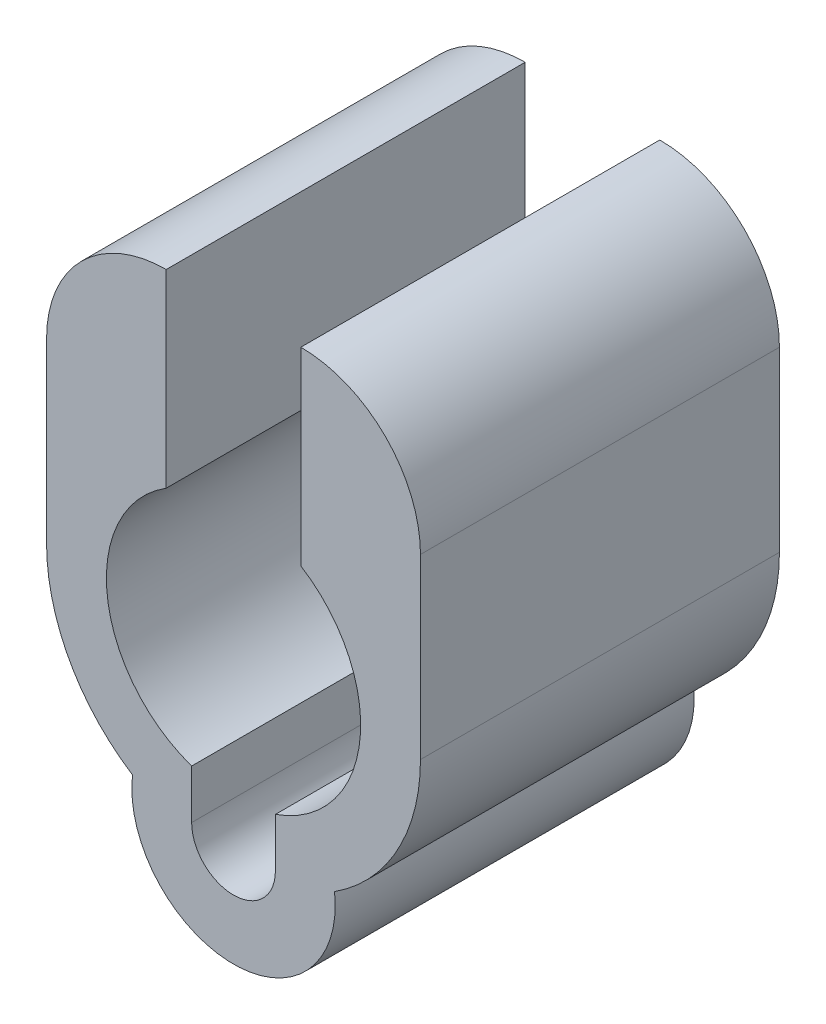
ISO-10303-21;
HEADER;
FILE_DESCRIPTION(('STEP AP214'),'2;1');
FILE_NAME('part.step','',(''),(''),'','','');
FILE_SCHEMA(('AUTOMOTIVE_DESIGN { 1 0 10303 214 1 1 1 1 }'));
ENDSEC;
DATA;
#1=APPLICATION_CONTEXT('core data for automotive mechanical design processes');
#2=APPLICATION_PROTOCOL_DEFINITION('international standard','automotive_design',2000,#1);
#3=PRODUCT_CONTEXT('',#1,'mechanical');
#4=PRODUCT('Part','Part','',(#3));
#5=PRODUCT_RELATED_PRODUCT_CATEGORY('part','',(#4));
#6=PRODUCT_DEFINITION_FORMATION('','',#4);
#7=PRODUCT_DEFINITION_CONTEXT('part definition',#1,'design');
#8=PRODUCT_DEFINITION('design','',#6,#7);
#9=PRODUCT_DEFINITION_SHAPE('','',#8);
#10=(LENGTH_UNIT() NAMED_UNIT(*) SI_UNIT(.MILLI.,.METRE.));
#11=(NAMED_UNIT(*) PLANE_ANGLE_UNIT() SI_UNIT($,.RADIAN.));
#12=(NAMED_UNIT(*) SI_UNIT($,.STERADIAN.) SOLID_ANGLE_UNIT());
#13=UNCERTAINTY_MEASURE_WITH_UNIT(LENGTH_MEASURE(1.E-05),#10,'distance_accuracy_value','');
#14=(GEOMETRIC_REPRESENTATION_CONTEXT(3) GLOBAL_UNCERTAINTY_ASSIGNED_CONTEXT((#13)) GLOBAL_UNIT_ASSIGNED_CONTEXT((#10,
#11,#12)) REPRESENTATION_CONTEXT('',''));
#15=CARTESIAN_POINT('',(0.,0.,0.));
#16=DIRECTION('',(0.,0.,1.));
#17=DIRECTION('',(1.,0.,0.));
#18=AXIS2_PLACEMENT_3D('',#15,#16,#17);
#19=CARTESIAN_POINT('',(0.,0.,10.));
#20=DIRECTION('',(0.,0.,-1.));
#21=DIRECTION('',(-1.,0.,0.));
#22=AXIS2_PLACEMENT_3D('',#19,#20,#21);
#23=CYLINDRICAL_SURFACE('',#22,4.25);
#24=DIRECTION('',(0.,0.,-1.));
#25=VECTOR('',#24,1.);
#26=CARTESIAN_POINT('',(-1.4,-4.01279204544666,10.));
#27=LINE('',#26,#25);
#28=CARTESIAN_POINT('',(-1.4,-4.01279204544666,10.));
#29=VERTEX_POINT('',#28);
#30=CARTESIAN_POINT('',(-1.4,-4.01279204544666,-2.));
#31=VERTEX_POINT('',#30);
#32=EDGE_CURVE('E146',#29,#31,#27,.T.);
#33=ORIENTED_EDGE('',*,*,#32,.T.);
#34=CARTESIAN_POINT('',(0.,0.,-2.));
#35=DIRECTION('',(0.,0.,1.));
#36=DIRECTION('',(1.,0.,0.));
#37=AXIS2_PLACEMENT_3D('',#34,#35,#36);
#38=CIRCLE('',#37,4.25);
#39=CARTESIAN_POINT('',(-2.25,3.60555127546399,-2.));
#40=VERTEX_POINT('',#39);
#41=EDGE_CURVE('E145',#40,#31,#38,.T.);
#42=ORIENTED_EDGE('',*,*,#41,.F.);
#43=DIRECTION('',(0.,0.,-1.));
#44=VECTOR('',#43,1.);
#45=CARTESIAN_POINT('',(-2.25,3.60555127546399,10.));
#46=LINE('',#45,#44);
#47=CARTESIAN_POINT('',(-2.25,3.60555127546399,10.));
#48=VERTEX_POINT('',#47);
#49=EDGE_CURVE('E11',#48,#40,#46,.T.);
#50=ORIENTED_EDGE('',*,*,#49,.F.);
#51=CARTESIAN_POINT('',(0.,0.,10.));
#52=DIRECTION('',(0.,0.,1.));
#53=DIRECTION('',(1.,0.,0.));
#54=AXIS2_PLACEMENT_3D('',#51,#52,#53);
#55=CIRCLE('',#54,4.25);
#56=EDGE_CURVE('E188',#48,#29,#55,.T.);
#57=ORIENTED_EDGE('',*,*,#56,.T.);
#58=EDGE_LOOP('',(#33,#42,#50,#57));
#59=FACE_BOUND('',#58,.T.);
#60=ADVANCED_FACE('F35',(#59),#23,.F.);
#61=CARTESIAN_POINT('',(-2.25,-17.3795150195168,10.));
#62=DIRECTION('',(-1.,0.,0.));
#63=DIRECTION('',(0.,0.,1.));
#64=AXIS2_PLACEMENT_3D('',#61,#62,#63);
#65=PLANE('',#64);
#66=ORIENTED_EDGE('',*,*,#49,.T.);
#67=DIRECTION('',(0.,1.,0.));
#68=VECTOR('',#67,1.);
#69=CARTESIAN_POINT('',(-2.25,-17.3795150195168,-2.));
#70=LINE('',#69,#68);
#71=CARTESIAN_POINT('',(-2.24999999999997,9.9372403713609,-2.));
#72=VERTEX_POINT('',#71);
#73=EDGE_CURVE('E140',#40,#72,#70,.T.);
#74=ORIENTED_EDGE('',*,*,#73,.T.);
#75=DIRECTION('',(0.,0.,-1.));
#76=VECTOR('',#75,1.);
#77=CARTESIAN_POINT('',(-2.24999999999997,9.9372403713609,10.));
#78=LINE('',#77,#76);
#79=CARTESIAN_POINT('',(-2.24999999999997,9.9372403713609,10.));
#80=VERTEX_POINT('',#79);
#81=EDGE_CURVE('E43',#80,#72,#78,.T.);
#82=ORIENTED_EDGE('',*,*,#81,.F.);
#83=DIRECTION('',(0.,1.,0.));
#84=VECTOR('',#83,1.);
#85=CARTESIAN_POINT('',(-2.25,-17.3795150195168,10.));
#86=LINE('',#85,#84);
#87=EDGE_CURVE('E141',#48,#80,#86,.T.);
#88=ORIENTED_EDGE('',*,*,#87,.F.);
#89=EDGE_LOOP('',(#66,#74,#82,#88));
#90=FACE_BOUND('',#89,.T.);
#91=ADVANCED_FACE('F37',(#90),#65,.F.);
#92=CARTESIAN_POINT('',(-2.25,5.9372403713609,10.));
#93=DIRECTION('',(0.,0.,-1.));
#94=DIRECTION('',(-1.,0.,0.));
#95=AXIS2_PLACEMENT_3D('',#92,#93,#94);
#96=CYLINDRICAL_SURFACE('',#95,4.);
#97=ORIENTED_EDGE('',*,*,#81,.T.);
#98=CARTESIAN_POINT('',(-2.25,5.9372403713609,-2.));
#99=DIRECTION('',(0.,0.,1.));
#100=DIRECTION('',(1.,0.,0.));
#101=AXIS2_PLACEMENT_3D('',#98,#99,#100);
#102=CIRCLE('',#101,4.);
#103=CARTESIAN_POINT('',(-6.25,5.93724037136087,-2.));
#104=VERTEX_POINT('',#103);
#105=EDGE_CURVE('E156',#104,#72,#102,.F.);
#106=ORIENTED_EDGE('',*,*,#105,.F.);
#107=DIRECTION('',(0.,0.,-1.));
#108=VECTOR('',#107,1.);
#109=CARTESIAN_POINT('',(-6.25,5.93724037136087,10.));
#110=LINE('',#109,#108);
#111=CARTESIAN_POINT('',(-6.25,5.93724037136087,10.));
#112=VERTEX_POINT('',#111);
#113=EDGE_CURVE('E237',#112,#104,#110,.T.);
#114=ORIENTED_EDGE('',*,*,#113,.F.);
#115=CARTESIAN_POINT('',(-2.25,5.9372403713609,10.));
#116=DIRECTION('',(0.,0.,1.));
#117=DIRECTION('',(1.,0.,0.));
#118=AXIS2_PLACEMENT_3D('',#115,#116,#117);
#119=CIRCLE('',#118,4.);
#120=EDGE_CURVE('E192',#112,#80,#119,.F.);
#121=ORIENTED_EDGE('',*,*,#120,.T.);
#122=EDGE_LOOP('',(#97,#106,#114,#121));
#123=FACE_BOUND('',#122,.T.);
#124=ADVANCED_FACE('F239',(#123),#96,.T.);
#125=CARTESIAN_POINT('',(-6.25,-17.3795150195168,10.));
#126=DIRECTION('',(-1.,0.,0.));
#127=DIRECTION('',(0.,0.,1.));
#128=AXIS2_PLACEMENT_3D('',#125,#126,#127);
#129=PLANE('',#128);
#130=ORIENTED_EDGE('',*,*,#113,.T.);
#131=DIRECTION('',(0.,1.,0.));
#132=VECTOR('',#131,1.);
#133=CARTESIAN_POINT('',(-6.25,-17.3795150195168,-2.));
#134=LINE('',#133,#132);
#135=CARTESIAN_POINT('',(-6.25,0.,-2.));
#136=VERTEX_POINT('',#135);
#137=EDGE_CURVE('E158',#136,#104,#134,.T.);
#138=ORIENTED_EDGE('',*,*,#137,.F.);
#139=DIRECTION('',(0.,0.,-1.));
#140=VECTOR('',#139,1.);
#141=CARTESIAN_POINT('',(-6.25,0.,10.));
#142=LINE('',#141,#140);
#143=CARTESIAN_POINT('',(-6.25,0.,10.));
#144=VERTEX_POINT('',#143);
#145=EDGE_CURVE('E235',#144,#136,#142,.T.);
#146=ORIENTED_EDGE('',*,*,#145,.F.);
#147=DIRECTION('',(0.,1.,0.));
#148=VECTOR('',#147,1.);
#149=CARTESIAN_POINT('',(-6.25,-17.3795150195168,10.));
#150=LINE('',#149,#148);
#151=EDGE_CURVE('E195',#144,#112,#150,.T.);
#152=ORIENTED_EDGE('',*,*,#151,.T.);
#153=EDGE_LOOP('',(#130,#138,#146,#152));
#154=FACE_BOUND('',#153,.T.);
#155=ADVANCED_FACE('F244',(#154),#129,.T.);
#156=CARTESIAN_POINT('',(0.,0.,10.));
#157=DIRECTION('',(0.,0.,-1.));
#158=DIRECTION('',(-1.,0.,0.));
#159=AXIS2_PLACEMENT_3D('',#156,#157,#158);
#160=CYLINDRICAL_SURFACE('',#159,6.25);
#161=ORIENTED_EDGE('',*,*,#145,.T.);
#162=CARTESIAN_POINT('',(0.,0.,-2.));
#163=DIRECTION('',(0.,0.,1.));
#164=DIRECTION('',(1.,0.,0.));
#165=AXIS2_PLACEMENT_3D('',#162,#163,#164);
#166=CIRCLE('',#165,6.25);
#167=CARTESIAN_POINT('',(-3.37742525177825,-5.25884955752213,-2.));
#168=VERTEX_POINT('',#167);
#169=EDGE_CURVE('E162',#136,#168,#166,.T.);
#170=ORIENTED_EDGE('',*,*,#169,.T.);
#171=DIRECTION('',(0.,0.,-1.));
#172=VECTOR('',#171,1.);
#173=CARTESIAN_POINT('',(-3.37742525177825,-5.25884955752213,10.));
#174=LINE('',#173,#172);
#175=CARTESIAN_POINT('',(-3.37742525177825,-5.25884955752213,10.));
#176=VERTEX_POINT('',#175);
#177=EDGE_CURVE('E233',#176,#168,#174,.T.);
#178=ORIENTED_EDGE('',*,*,#177,.F.);
#179=CARTESIAN_POINT('',(0.,0.,10.));
#180=DIRECTION('',(0.,0.,1.));
#181=DIRECTION('',(1.,0.,0.));
#182=AXIS2_PLACEMENT_3D('',#179,#180,#181);
#183=CIRCLE('',#182,6.25);
#184=EDGE_CURVE('E198',#144,#176,#183,.T.);
#185=ORIENTED_EDGE('',*,*,#184,.F.);
#186=EDGE_LOOP('',(#161,#170,#178,#185));
#187=FACE_BOUND('',#186,.T.);
#188=ADVANCED_FACE('F250',(#187),#160,.T.);
#189=CARTESIAN_POINT('',(0.,-5.65,10.));
#190=DIRECTION('',(0.,0.,-1.));
#191=DIRECTION('',(-1.,0.,0.));
#192=AXIS2_PLACEMENT_3D('',#189,#190,#191);
#193=CYLINDRICAL_SURFACE('',#192,3.4);
#194=ORIENTED_EDGE('',*,*,#177,.T.);
#195=CARTESIAN_POINT('',(0.,-5.65,-2.));
#196=DIRECTION('',(0.,0.,1.));
#197=DIRECTION('',(1.,0.,0.));
#198=AXIS2_PLACEMENT_3D('',#195,#196,#197);
#199=CIRCLE('',#198,3.4);
#200=CARTESIAN_POINT('',(3.37742525177825,-5.25884955752212,-2.));
#201=VERTEX_POINT('',#200);
#202=EDGE_CURVE('E165',#168,#201,#199,.T.);
#203=ORIENTED_EDGE('',*,*,#202,.T.);
#204=DIRECTION('',(0.,0.,-1.));
#205=VECTOR('',#204,1.);
#206=CARTESIAN_POINT('',(3.37742525177825,-5.25884955752212,10.));
#207=LINE('',#206,#205);
#208=CARTESIAN_POINT('',(3.37742525177825,-5.25884955752212,10.));
#209=VERTEX_POINT('',#208);
#210=EDGE_CURVE('E231',#209,#201,#207,.T.);
#211=ORIENTED_EDGE('',*,*,#210,.F.);
#212=CARTESIAN_POINT('',(0.,-5.65,10.));
#213=DIRECTION('',(0.,0.,1.));
#214=DIRECTION('',(1.,0.,0.));
#215=AXIS2_PLACEMENT_3D('',#212,#213,#214);
#216=CIRCLE('',#215,3.4);
#217=EDGE_CURVE('E200',#176,#209,#216,.T.);
#218=ORIENTED_EDGE('',*,*,#217,.F.);
#219=EDGE_LOOP('',(#194,#203,#211,#218));
#220=FACE_BOUND('',#219,.T.);
#221=ADVANCED_FACE('F256',(#220),#193,.T.);
#222=CARTESIAN_POINT('',(0.,0.,10.));
#223=DIRECTION('',(0.,0.,-1.));
#224=DIRECTION('',(-1.,0.,0.));
#225=AXIS2_PLACEMENT_3D('',#222,#223,#224);
#226=CYLINDRICAL_SURFACE('',#225,6.25);
#227=ORIENTED_EDGE('',*,*,#210,.T.);
#228=CARTESIAN_POINT('',(0.,0.,-2.));
#229=DIRECTION('',(0.,0.,1.));
#230=DIRECTION('',(1.,0.,0.));
#231=AXIS2_PLACEMENT_3D('',#228,#229,#230);
#232=CIRCLE('',#231,6.25);
#233=CARTESIAN_POINT('',(6.25,0.,-2.));
#234=VERTEX_POINT('',#233);
#235=EDGE_CURVE('E168',#201,#234,#232,.T.);
#236=ORIENTED_EDGE('',*,*,#235,.T.);
#237=DIRECTION('',(0.,0.,-1.));
#238=VECTOR('',#237,1.);
#239=CARTESIAN_POINT('',(6.25,0.,10.));
#240=LINE('',#239,#238);
#241=CARTESIAN_POINT('',(6.25,0.,10.));
#242=VERTEX_POINT('',#241);
#243=EDGE_CURVE('E229',#242,#234,#240,.T.);
#244=ORIENTED_EDGE('',*,*,#243,.F.);
#245=CARTESIAN_POINT('',(0.,0.,10.));
#246=DIRECTION('',(0.,0.,1.));
#247=DIRECTION('',(1.,0.,0.));
#248=AXIS2_PLACEMENT_3D('',#245,#246,#247);
#249=CIRCLE('',#248,6.25);
#250=EDGE_CURVE('E202',#209,#242,#249,.T.);
#251=ORIENTED_EDGE('',*,*,#250,.F.);
#252=EDGE_LOOP('',(#227,#236,#244,#251));
#253=FACE_BOUND('',#252,.T.);
#254=ADVANCED_FACE('F260',(#253),#226,.T.);
#255=CARTESIAN_POINT('',(6.25,-17.3795150195168,10.));
#256=DIRECTION('',(-1.,0.,0.));
#257=DIRECTION('',(0.,0.,1.));
#258=AXIS2_PLACEMENT_3D('',#255,#256,#257);
#259=PLANE('',#258);
#260=ORIENTED_EDGE('',*,*,#243,.T.);
#261=DIRECTION('',(0.,1.,0.));
#262=VECTOR('',#261,1.);
#263=CARTESIAN_POINT('',(6.25,-17.3795150195168,-2.));
#264=LINE('',#263,#262);
#265=CARTESIAN_POINT('',(6.25,5.93724037136087,-2.));
#266=VERTEX_POINT('',#265);
#267=EDGE_CURVE('E171',#234,#266,#264,.T.);
#268=ORIENTED_EDGE('',*,*,#267,.T.);
#269=DIRECTION('',(0.,0.,-1.));
#270=VECTOR('',#269,1.);
#271=CARTESIAN_POINT('',(6.25,5.93724037136087,10.));
#272=LINE('',#271,#270);
#273=CARTESIAN_POINT('',(6.25,5.93724037136087,10.));
#274=VERTEX_POINT('',#273);
#275=EDGE_CURVE('E227',#274,#266,#272,.T.);
#276=ORIENTED_EDGE('',*,*,#275,.F.);
#277=DIRECTION('',(0.,1.,0.));
#278=VECTOR('',#277,1.);
#279=CARTESIAN_POINT('',(6.25,-17.3795150195168,10.));
#280=LINE('',#279,#278);
#281=EDGE_CURVE('E204',#242,#274,#280,.T.);
#282=ORIENTED_EDGE('',*,*,#281,.F.);
#283=EDGE_LOOP('',(#260,#268,#276,#282));
#284=FACE_BOUND('',#283,.T.);
#285=ADVANCED_FACE('F265',(#284),#259,.F.);
#286=CARTESIAN_POINT('',(2.25,5.9372403713609,10.));
#287=DIRECTION('',(0.,0.,-1.));
#288=DIRECTION('',(-1.,0.,0.));
#289=AXIS2_PLACEMENT_3D('',#286,#287,#288);
#290=CYLINDRICAL_SURFACE('',#289,4.);
#291=ORIENTED_EDGE('',*,*,#275,.T.);
#292=CARTESIAN_POINT('',(2.25,5.9372403713609,-2.));
#293=DIRECTION('',(0.,0.,1.));
#294=DIRECTION('',(1.,0.,0.));
#295=AXIS2_PLACEMENT_3D('',#292,#293,#294);
#296=CIRCLE('',#295,4.);
#297=CARTESIAN_POINT('',(2.24999999999997,9.9372403713609,-2.));
#298=VERTEX_POINT('',#297);
#299=EDGE_CURVE('E174',#266,#298,#296,.T.);
#300=ORIENTED_EDGE('',*,*,#299,.T.);
#301=DIRECTION('',(0.,0.,-1.));
#302=VECTOR('',#301,1.);
#303=CARTESIAN_POINT('',(2.24999999999997,9.9372403713609,10.));
#304=LINE('',#303,#302);
#305=CARTESIAN_POINT('',(2.24999999999997,9.9372403713609,10.));
#306=VERTEX_POINT('',#305);
#307=EDGE_CURVE('E225',#306,#298,#304,.T.);
#308=ORIENTED_EDGE('',*,*,#307,.F.);
#309=CARTESIAN_POINT('',(2.25,5.9372403713609,10.));
#310=DIRECTION('',(0.,0.,1.));
#311=DIRECTION('',(1.,0.,0.));
#312=AXIS2_PLACEMENT_3D('',#309,#310,#311);
#313=CIRCLE('',#312,4.);
#314=EDGE_CURVE('E206',#274,#306,#313,.T.);
#315=ORIENTED_EDGE('',*,*,#314,.F.);
#316=EDGE_LOOP('',(#291,#300,#308,#315));
#317=FACE_BOUND('',#316,.T.);
#318=ADVANCED_FACE('F272',(#317),#290,.T.);
#319=CARTESIAN_POINT('',(2.25,-17.3795150195168,10.));
#320=DIRECTION('',(-1.,0.,0.));
#321=DIRECTION('',(0.,-1.,0.));
#322=AXIS2_PLACEMENT_3D('',#319,#320,#321);
#323=PLANE('',#322);
#324=ORIENTED_EDGE('',*,*,#307,.T.);
#325=DIRECTION('',(0.,1.,0.));
#326=VECTOR('',#325,1.);
#327=CARTESIAN_POINT('',(2.25,-17.3795150195168,-2.));
#328=LINE('',#327,#326);
#329=CARTESIAN_POINT('',(2.25,3.60555127546399,-2.));
#330=VERTEX_POINT('',#329);
#331=EDGE_CURVE('E177',#330,#298,#328,.T.);
#332=ORIENTED_EDGE('',*,*,#331,.F.);
#333=DIRECTION('',(0.,0.,-1.));
#334=VECTOR('',#333,1.);
#335=CARTESIAN_POINT('',(2.25,3.60555127546399,10.));
#336=LINE('',#335,#334);
#337=CARTESIAN_POINT('',(2.25,3.60555127546399,10.));
#338=VERTEX_POINT('',#337);
#339=EDGE_CURVE('E223',#338,#330,#336,.T.);
#340=ORIENTED_EDGE('',*,*,#339,.F.);
#341=DIRECTION('',(0.,1.,0.));
#342=VECTOR('',#341,1.);
#343=CARTESIAN_POINT('',(2.25,-17.3795150195168,10.));
#344=LINE('',#343,#342);
#345=EDGE_CURVE('E208',#338,#306,#344,.T.);
#346=ORIENTED_EDGE('',*,*,#345,.T.);
#347=EDGE_LOOP('',(#324,#332,#340,#346));
#348=FACE_BOUND('',#347,.T.);
#349=ADVANCED_FACE('F276',(#348),#323,.T.);
#350=ORIENTED_EDGE('',*,*,#339,.T.);
#351=CARTESIAN_POINT('',(1.4,-4.01279204544666,-2.));
#352=VERTEX_POINT('',#351);
#353=EDGE_CURVE('E151',#352,#330,#38,.T.);
#354=ORIENTED_EDGE('',*,*,#353,.F.);
#355=DIRECTION('',(0.,0.,-1.));
#356=VECTOR('',#355,1.);
#357=CARTESIAN_POINT('',(1.4,-4.01279204544666,10.));
#358=LINE('',#357,#356);
#359=CARTESIAN_POINT('',(1.4,-4.01279204544666,10.));
#360=VERTEX_POINT('',#359);
#361=EDGE_CURVE('E221',#360,#352,#358,.T.);
#362=ORIENTED_EDGE('',*,*,#361,.F.);
#363=EDGE_CURVE('E190',#360,#338,#55,.T.);
#364=ORIENTED_EDGE('',*,*,#363,.T.);
#365=EDGE_LOOP('',(#350,#354,#362,#364));
#366=FACE_BOUND('',#365,.T.);
#367=ADVANCED_FACE('F280',(#366),#23,.F.);
#368=CARTESIAN_POINT('',(1.4,-17.3795150195168,10.));
#369=DIRECTION('',(-1.,0.,0.));
#370=DIRECTION('',(0.,0.,1.));
#371=AXIS2_PLACEMENT_3D('',#368,#369,#370);
#372=PLANE('',#371);
#373=ORIENTED_EDGE('',*,*,#361,.T.);
#374=DIRECTION('',(0.,1.,0.));
#375=VECTOR('',#374,1.);
#376=CARTESIAN_POINT('',(1.4,-17.3795150195168,-2.));
#377=LINE('',#376,#375);
#378=CARTESIAN_POINT('',(1.4,-5.65,-2.));
#379=VERTEX_POINT('',#378);
#380=EDGE_CURVE('E180',#379,#352,#377,.T.);
#381=ORIENTED_EDGE('',*,*,#380,.F.);
#382=DIRECTION('',(0.,0.,-1.));
#383=VECTOR('',#382,1.);
#384=CARTESIAN_POINT('',(1.4,-5.65,10.));
#385=LINE('',#384,#383);
#386=CARTESIAN_POINT('',(1.4,-5.65,10.));
#387=VERTEX_POINT('',#386);
#388=EDGE_CURVE('E219',#387,#379,#385,.T.);
#389=ORIENTED_EDGE('',*,*,#388,.F.);
#390=DIRECTION('',(0.,1.,0.));
#391=VECTOR('',#390,1.);
#392=CARTESIAN_POINT('',(1.4,-17.3795150195168,10.));
#393=LINE('',#392,#391);
#394=EDGE_CURVE('E211',#387,#360,#393,.T.);
#395=ORIENTED_EDGE('',*,*,#394,.T.);
#396=EDGE_LOOP('',(#373,#381,#389,#395));
#397=FACE_BOUND('',#396,.T.);
#398=ADVANCED_FACE('F283',(#397),#372,.T.);
#399=CARTESIAN_POINT('',(0.,-5.65,10.));
#400=DIRECTION('',(0.,0.,-1.));
#401=DIRECTION('',(-1.,0.,0.));
#402=AXIS2_PLACEMENT_3D('',#399,#400,#401);
#403=CYLINDRICAL_SURFACE('',#402,1.4);
#404=ORIENTED_EDGE('',*,*,#388,.T.);
#405=CARTESIAN_POINT('',(0.,-5.65,-2.));
#406=DIRECTION('',(0.,0.,1.));
#407=DIRECTION('',(1.,0.,0.));
#408=AXIS2_PLACEMENT_3D('',#405,#406,#407);
#409=CIRCLE('',#408,1.4);
#410=CARTESIAN_POINT('',(-1.4,-5.65,-2.));
#411=VERTEX_POINT('',#410);
#412=EDGE_CURVE('E183',#411,#379,#409,.T.);
#413=ORIENTED_EDGE('',*,*,#412,.F.);
#414=DIRECTION('',(0.,0.,-1.));
#415=VECTOR('',#414,1.);
#416=CARTESIAN_POINT('',(-1.4,-5.65,10.));
#417=LINE('',#416,#415);
#418=CARTESIAN_POINT('',(-1.4,-5.65,10.));
#419=VERTEX_POINT('',#418);
#420=EDGE_CURVE('E58',#419,#411,#417,.T.);
#421=ORIENTED_EDGE('',*,*,#420,.F.);
#422=CARTESIAN_POINT('',(0.,-5.65,10.));
#423=DIRECTION('',(0.,0.,1.));
#424=DIRECTION('',(1.,0.,0.));
#425=AXIS2_PLACEMENT_3D('',#422,#423,#424);
#426=CIRCLE('',#425,1.4);
#427=EDGE_CURVE('E214',#419,#387,#426,.T.);
#428=ORIENTED_EDGE('',*,*,#427,.T.);
#429=EDGE_LOOP('',(#404,#413,#421,#428));
#430=FACE_BOUND('',#429,.T.);
#431=ADVANCED_FACE('F285',(#430),#403,.F.);
#432=CARTESIAN_POINT('',(-1.4,-17.3795150195168,10.));
#433=DIRECTION('',(-1.,0.,0.));
#434=DIRECTION('',(0.,0.,1.));
#435=AXIS2_PLACEMENT_3D('',#432,#433,#434);
#436=PLANE('',#435);
#437=ORIENTED_EDGE('',*,*,#420,.T.);
#438=DIRECTION('',(0.,1.,0.));
#439=VECTOR('',#438,1.);
#440=CARTESIAN_POINT('',(-1.4,-17.3795150195168,-2.));
#441=LINE('',#440,#439);
#442=EDGE_CURVE('E186',#411,#31,#441,.T.);
#443=ORIENTED_EDGE('',*,*,#442,.T.);
#444=ORIENTED_EDGE('',*,*,#32,.F.);
#445=DIRECTION('',(0.,1.,0.));
#446=VECTOR('',#445,1.);
#447=CARTESIAN_POINT('',(-1.4,-17.3795150195168,10.));
#448=LINE('',#447,#446);
#449=EDGE_CURVE('E50',#419,#29,#448,.T.);
#450=ORIENTED_EDGE('',*,*,#449,.F.);
#451=EDGE_LOOP('',(#437,#443,#444,#450));
#452=FACE_BOUND('',#451,.T.);
#453=ADVANCED_FACE('F287',(#452),#436,.F.);
#454=CARTESIAN_POINT('',(0.,-17.3795150195168,10.));
#455=DIRECTION('',(0.,0.,1.));
#456=DIRECTION('',(1.,0.,0.));
#457=AXIS2_PLACEMENT_3D('',#454,#455,#456);
#458=PLANE('',#457);
#459=ORIENTED_EDGE('',*,*,#56,.F.);
#460=ORIENTED_EDGE('',*,*,#87,.T.);
#461=ORIENTED_EDGE('',*,*,#120,.F.);
#462=ORIENTED_EDGE('',*,*,#151,.F.);
#463=ORIENTED_EDGE('',*,*,#184,.T.);
#464=ORIENTED_EDGE('',*,*,#217,.T.);
#465=ORIENTED_EDGE('',*,*,#250,.T.);
#466=ORIENTED_EDGE('',*,*,#281,.T.);
#467=ORIENTED_EDGE('',*,*,#314,.T.);
#468=ORIENTED_EDGE('',*,*,#345,.F.);
#469=ORIENTED_EDGE('',*,*,#363,.F.);
#470=ORIENTED_EDGE('',*,*,#394,.F.);
#471=ORIENTED_EDGE('',*,*,#427,.F.);
#472=ORIENTED_EDGE('',*,*,#449,.T.);
#473=EDGE_LOOP('',(#459,#460,#461,#462,#463,#464,#465,#466,#467,#468,#469,#470,#471,#472));
#474=FACE_BOUND('',#473,.T.);
#475=ADVANCED_FACE('F242',(#474),#458,.T.);
#476=CARTESIAN_POINT('',(0.,-17.3795150195168,-2.));
#477=DIRECTION('',(0.,0.,1.));
#478=DIRECTION('',(1.,0.,0.));
#479=AXIS2_PLACEMENT_3D('',#476,#477,#478);
#480=PLANE('',#479);
#481=ORIENTED_EDGE('',*,*,#41,.T.);
#482=ORIENTED_EDGE('',*,*,#442,.F.);
#483=ORIENTED_EDGE('',*,*,#412,.T.);
#484=ORIENTED_EDGE('',*,*,#380,.T.);
#485=ORIENTED_EDGE('',*,*,#353,.T.);
#486=ORIENTED_EDGE('',*,*,#331,.T.);
#487=ORIENTED_EDGE('',*,*,#299,.F.);
#488=ORIENTED_EDGE('',*,*,#267,.F.);
#489=ORIENTED_EDGE('',*,*,#235,.F.);
#490=ORIENTED_EDGE('',*,*,#202,.F.);
#491=ORIENTED_EDGE('',*,*,#169,.F.);
#492=ORIENTED_EDGE('',*,*,#137,.T.);
#493=ORIENTED_EDGE('',*,*,#105,.T.);
#494=ORIENTED_EDGE('',*,*,#73,.F.);
#495=EDGE_LOOP('',(#481,#482,#483,#484,#485,#486,#487,#488,#489,#490,#491,#492,#493,#494));
#496=FACE_BOUND('',#495,.T.);
#497=ADVANCED_FACE('F153',(#496),#480,.F.);
#498=CLOSED_SHELL('',(#60,#91,#124,#155,#188,#221,#254,#285,#318,#349,#367,#398,#431,#453,#475,#497));
#499=MANIFOLD_SOLID_BREP('B2',#498);
#500=ADVANCED_BREP_SHAPE_REPRESENTATION('',(#18,#499),#14);
#501=SHAPE_DEFINITION_REPRESENTATION(#9,#500);
ENDSEC;
END-ISO-10303-21;
